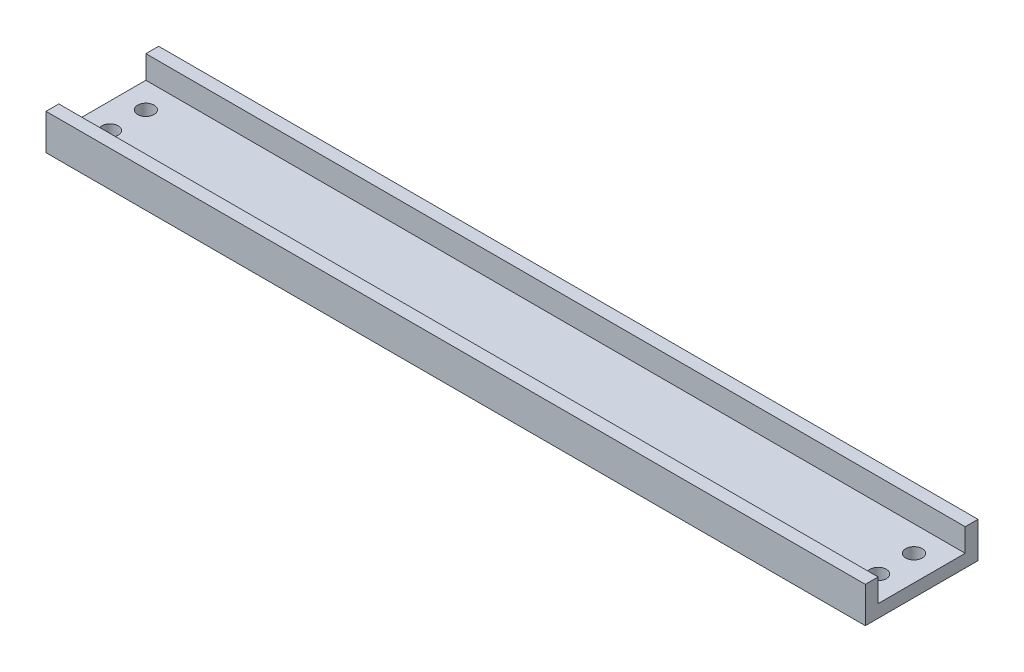
ISO-10303-21;
HEADER;
FILE_DESCRIPTION(('STEP AP214'),'2;1');
FILE_NAME('part.step','',(''),(''),'','','');
FILE_SCHEMA(('AUTOMOTIVE_DESIGN { 1 0 10303 214 1 1 1 1 }'));
ENDSEC;
DATA;
#1=APPLICATION_CONTEXT('core data for automotive mechanical design processes');
#2=APPLICATION_PROTOCOL_DEFINITION('international standard','automotive_design',2000,#1);
#3=PRODUCT_CONTEXT('',#1,'mechanical');
#4=PRODUCT('Part','Part','',(#3));
#5=PRODUCT_RELATED_PRODUCT_CATEGORY('part','',(#4));
#6=PRODUCT_DEFINITION_FORMATION('','',#4);
#7=PRODUCT_DEFINITION_CONTEXT('part definition',#1,'design');
#8=PRODUCT_DEFINITION('design','',#6,#7);
#9=PRODUCT_DEFINITION_SHAPE('','',#8);
#10=(LENGTH_UNIT() NAMED_UNIT(*) SI_UNIT(.MILLI.,.METRE.));
#11=(NAMED_UNIT(*) PLANE_ANGLE_UNIT() SI_UNIT($,.RADIAN.));
#12=(NAMED_UNIT(*) SI_UNIT($,.STERADIAN.) SOLID_ANGLE_UNIT());
#13=UNCERTAINTY_MEASURE_WITH_UNIT(LENGTH_MEASURE(1.E-05),#10,'distance_accuracy_value','');
#14=(GEOMETRIC_REPRESENTATION_CONTEXT(3) GLOBAL_UNCERTAINTY_ASSIGNED_CONTEXT((#13)) GLOBAL_UNIT_ASSIGNED_CONTEXT((#10,
#11,#12)) REPRESENTATION_CONTEXT('',''));
#15=CARTESIAN_POINT('',(0.,0.,0.));
#16=DIRECTION('',(0.,0.,1.));
#17=DIRECTION('',(1.,0.,0.));
#18=AXIS2_PLACEMENT_3D('',#15,#16,#17);
#19=CARTESIAN_POINT('',(0.,1.25,0.));
#20=DIRECTION('',(0.,1.,0.));
#21=DIRECTION('',(0.,0.,1.));
#22=AXIS2_PLACEMENT_3D('',#19,#20,#21);
#23=PLANE('',#22);
#24=CARTESIAN_POINT('',(-76.0810810810811,1.25,3.35585585585585));
#25=DIRECTION('',(0.,1.,0.));
#26=DIRECTION('',(0.,0.,-1.));
#27=AXIS2_PLACEMENT_3D('',#24,#25,#26);
#28=CIRCLE('',#27,1.60000000000001);
#29=CARTESIAN_POINT('',(-76.0810810810811,1.25,1.75585585585584));
#30=VERTEX_POINT('',#29);
#31=EDGE_CURVE('E333',#30,#30,#28,.T.);
#32=ORIENTED_EDGE('',*,*,#31,.F.);
#33=EDGE_LOOP('',(#32));
#34=FACE_BOUND('',#33,.T.);
#35=CARTESIAN_POINT('',(-76.0810810810811,1.25,10.3558558558558));
#36=DIRECTION('',(0.,1.,0.));
#37=DIRECTION('',(0.,0.,-1.));
#38=AXIS2_PLACEMENT_3D('',#35,#36,#37);
#39=CIRCLE('',#38,1.6);
#40=CARTESIAN_POINT('',(-76.0810810810811,1.25,8.75585585585585));
#41=VERTEX_POINT('',#40);
#42=EDGE_CURVE('E335',#41,#41,#39,.T.);
#43=ORIENTED_EDGE('',*,*,#42,.F.);
#44=EDGE_LOOP('',(#43));
#45=FACE_BOUND('',#44,.T.);
#46=CARTESIAN_POINT('',(73.9189189189189,1.25,10.3558558558558));
#47=DIRECTION('',(0.,1.,0.));
#48=DIRECTION('',(0.,0.,1.));
#49=AXIS2_PLACEMENT_3D('',#46,#47,#48);
#50=CIRCLE('',#49,1.6);
#51=CARTESIAN_POINT('',(73.9189189189189,1.25,11.9558558558559));
#52=VERTEX_POINT('',#51);
#53=EDGE_CURVE('E346',#52,#52,#50,.T.);
#54=ORIENTED_EDGE('',*,*,#53,.F.);
#55=EDGE_LOOP('',(#54));
#56=FACE_BOUND('',#55,.T.);
#57=CARTESIAN_POINT('',(73.9189189189189,1.25,3.35585585585585));
#58=DIRECTION('',(0.,1.,0.));
#59=DIRECTION('',(0.,0.,1.));
#60=AXIS2_PLACEMENT_3D('',#57,#58,#59);
#61=CIRCLE('',#60,1.60000000000001);
#62=CARTESIAN_POINT('',(73.9189189189189,1.25,4.95585585585585));
#63=VERTEX_POINT('',#62);
#64=EDGE_CURVE('E133',#63,#63,#61,.T.);
#65=ORIENTED_EDGE('',*,*,#64,.F.);
#66=EDGE_LOOP('',(#65));
#67=FACE_BOUND('',#66,.T.);
#68=DIRECTION('',(0.,0.,1.));
#69=VECTOR('',#68,1.);
#70=CARTESIAN_POINT('',(-81.0810810810811,1.25,-4.14414414414415));
#71=LINE('',#70,#69);
#72=CARTESIAN_POINT('',(-81.0810810810811,1.25,-1.64414414414415));
#73=VERTEX_POINT('',#72);
#74=CARTESIAN_POINT('',(-81.0810810810811,1.25,15.3558558558558));
#75=VERTEX_POINT('',#74);
#76=EDGE_CURVE('E161',#73,#75,#71,.T.);
#77=ORIENTED_EDGE('',*,*,#76,.T.);
#78=DIRECTION('',(-1.,0.,0.));
#79=VECTOR('',#78,1.);
#80=CARTESIAN_POINT('',(-81.0810810810811,1.25,15.3558558558558));
#81=LINE('',#80,#79);
#82=CARTESIAN_POINT('',(78.9189189189189,1.25,15.3558558558558));
#83=VERTEX_POINT('',#82);
#84=EDGE_CURVE('E128',#83,#75,#81,.T.);
#85=ORIENTED_EDGE('',*,*,#84,.F.);
#86=DIRECTION('',(0.,0.,-1.));
#87=VECTOR('',#86,1.);
#88=CARTESIAN_POINT('',(78.9189189189189,1.25,-4.14414414414415));
#89=LINE('',#88,#87);
#90=CARTESIAN_POINT('',(78.9189189189189,1.25,-1.64414414414415));
#91=VERTEX_POINT('',#90);
#92=EDGE_CURVE('E159',#83,#91,#89,.T.);
#93=ORIENTED_EDGE('',*,*,#92,.T.);
#94=DIRECTION('',(1.,0.,0.));
#95=VECTOR('',#94,1.);
#96=CARTESIAN_POINT('',(78.9189189189189,1.25,-1.64414414414415));
#97=LINE('',#96,#95);
#98=EDGE_CURVE('E60',#73,#91,#97,.T.);
#99=ORIENTED_EDGE('',*,*,#98,.F.);
#100=EDGE_LOOP('',(#77,#85,#93,#99));
#101=FACE_BOUND('',#100,.T.);
#102=ADVANCED_FACE('F37',(#34,#45,#56,#67,#101),#23,.T.);
#103=CARTESIAN_POINT('',(78.9189189189189,1.25,-4.14414414414415));
#104=DIRECTION('',(-1.,0.,0.));
#105=DIRECTION('',(0.,0.,1.));
#106=AXIS2_PLACEMENT_3D('',#103,#104,#105);
#107=PLANE('',#106);
#108=DIRECTION('',(0.,0.,-1.));
#109=VECTOR('',#108,1.);
#110=CARTESIAN_POINT('',(78.9189189189189,-1.25,-4.14414414414415));
#111=LINE('',#110,#109);
#112=CARTESIAN_POINT('',(78.9189189189189,-1.25,17.8558558558558));
#113=VERTEX_POINT('',#112);
#114=CARTESIAN_POINT('',(78.9189189189189,-1.25,-4.14414414414415));
#115=VERTEX_POINT('',#114);
#116=EDGE_CURVE('E158',#113,#115,#111,.T.);
#117=ORIENTED_EDGE('',*,*,#116,.T.);
#118=DIRECTION('',(0.,-1.,0.));
#119=VECTOR('',#118,1.);
#120=CARTESIAN_POINT('',(78.9189189189189,1.25,-4.14414414414415));
#121=LINE('',#120,#119);
#122=CARTESIAN_POINT('',(78.9189189189189,5.75,-4.14414414414415));
#123=VERTEX_POINT('',#122);
#124=EDGE_CURVE('E11',#123,#115,#121,.T.);
#125=ORIENTED_EDGE('',*,*,#124,.F.);
#126=DIRECTION('',(0.,0.,-1.));
#127=VECTOR('',#126,1.);
#128=CARTESIAN_POINT('',(78.9189189189189,5.75,-4.14414414414415));
#129=LINE('',#128,#127);
#130=CARTESIAN_POINT('',(78.9189189189189,5.75,-1.64414414414415));
#131=VERTEX_POINT('',#130);
#132=EDGE_CURVE('E141',#131,#123,#129,.T.);
#133=ORIENTED_EDGE('',*,*,#132,.F.);
#134=DIRECTION('',(0.,-1.,0.));
#135=VECTOR('',#134,1.);
#136=CARTESIAN_POINT('',(78.9189189189189,5.75,-1.64414414414415));
#137=LINE('',#136,#135);
#138=EDGE_CURVE('E151',#131,#91,#137,.T.);
#139=ORIENTED_EDGE('',*,*,#138,.T.);
#140=ORIENTED_EDGE('',*,*,#92,.F.);
#141=DIRECTION('',(0.,-1.,0.));
#142=VECTOR('',#141,1.);
#143=CARTESIAN_POINT('',(78.9189189189189,5.75,15.3558558558558));
#144=LINE('',#143,#142);
#145=CARTESIAN_POINT('',(78.9189189189189,5.75,15.3558558558558));
#146=VERTEX_POINT('',#145);
#147=EDGE_CURVE('E52',#146,#83,#144,.T.);
#148=ORIENTED_EDGE('',*,*,#147,.F.);
#149=DIRECTION('',(0.,0.,-1.));
#150=VECTOR('',#149,1.);
#151=CARTESIAN_POINT('',(78.9189189189189,5.75,17.8558558558558));
#152=LINE('',#151,#150);
#153=CARTESIAN_POINT('',(78.9189189189189,5.75,17.8558558558558));
#154=VERTEX_POINT('',#153);
#155=EDGE_CURVE('E123',#154,#146,#152,.T.);
#156=ORIENTED_EDGE('',*,*,#155,.F.);
#157=DIRECTION('',(0.,-1.,0.));
#158=VECTOR('',#157,1.);
#159=CARTESIAN_POINT('',(78.9189189189189,1.25,17.8558558558558));
#160=LINE('',#159,#158);
#161=EDGE_CURVE('E115',#154,#113,#160,.T.);
#162=ORIENTED_EDGE('',*,*,#161,.T.);
#163=EDGE_LOOP('',(#117,#125,#133,#139,#140,#148,#156,#162));
#164=FACE_BOUND('',#163,.T.);
#165=ADVANCED_FACE('F39',(#164),#107,.F.);
#166=CARTESIAN_POINT('',(-81.0810810810811,1.25,-4.14414414414415));
#167=DIRECTION('',(0.,0.,1.));
#168=DIRECTION('',(1.,0.,0.));
#169=AXIS2_PLACEMENT_3D('',#166,#167,#168);
#170=PLANE('',#169);
#171=DIRECTION('',(-1.,0.,0.));
#172=VECTOR('',#171,1.);
#173=CARTESIAN_POINT('',(-81.0810810810811,-1.25,-4.14414414414415));
#174=LINE('',#173,#172);
#175=CARTESIAN_POINT('',(-81.0810810810811,-1.25,-4.14414414414415));
#176=VERTEX_POINT('',#175);
#177=EDGE_CURVE('E166',#115,#176,#174,.T.);
#178=ORIENTED_EDGE('',*,*,#177,.T.);
#179=DIRECTION('',(0.,-1.,0.));
#180=VECTOR('',#179,1.);
#181=CARTESIAN_POINT('',(-81.0810810810811,1.25,-4.14414414414415));
#182=LINE('',#181,#180);
#183=CARTESIAN_POINT('',(-81.0810810810811,5.75,-4.14414414414415));
#184=VERTEX_POINT('',#183);
#185=EDGE_CURVE('E45',#184,#176,#182,.T.);
#186=ORIENTED_EDGE('',*,*,#185,.F.);
#187=DIRECTION('',(-1.,0.,0.));
#188=VECTOR('',#187,1.);
#189=CARTESIAN_POINT('',(78.9189189189189,5.75,-4.14414414414415));
#190=LINE('',#189,#188);
#191=EDGE_CURVE('E144',#123,#184,#190,.T.);
#192=ORIENTED_EDGE('',*,*,#191,.F.);
#193=ORIENTED_EDGE('',*,*,#124,.T.);
#194=EDGE_LOOP('',(#178,#186,#192,#193));
#195=FACE_BOUND('',#194,.T.);
#196=ADVANCED_FACE('F187',(#195),#170,.F.);
#197=CARTESIAN_POINT('',(-81.0810810810811,1.25,-4.14414414414415));
#198=DIRECTION('',(1.,0.,0.));
#199=DIRECTION('',(0.,0.,-1.));
#200=AXIS2_PLACEMENT_3D('',#197,#198,#199);
#201=PLANE('',#200);
#202=DIRECTION('',(0.,0.,1.));
#203=VECTOR('',#202,1.);
#204=CARTESIAN_POINT('',(-81.0810810810811,-1.25,-4.14414414414415));
#205=LINE('',#204,#203);
#206=CARTESIAN_POINT('',(-81.0810810810811,-1.25,17.8558558558558));
#207=VERTEX_POINT('',#206);
#208=EDGE_CURVE('E112',#176,#207,#205,.T.);
#209=ORIENTED_EDGE('',*,*,#208,.T.);
#210=DIRECTION('',(0.,-1.,0.));
#211=VECTOR('',#210,1.);
#212=CARTESIAN_POINT('',(-81.0810810810811,1.25,17.8558558558558));
#213=LINE('',#212,#211);
#214=CARTESIAN_POINT('',(-81.0810810810811,5.75,17.8558558558558));
#215=VERTEX_POINT('',#214);
#216=EDGE_CURVE('E104',#215,#207,#213,.T.);
#217=ORIENTED_EDGE('',*,*,#216,.F.);
#218=DIRECTION('',(0.,0.,1.));
#219=VECTOR('',#218,1.);
#220=CARTESIAN_POINT('',(-81.0810810810811,5.75,17.8558558558558));
#221=LINE('',#220,#219);
#222=CARTESIAN_POINT('',(-81.0810810810811,5.75,15.3558558558558));
#223=VERTEX_POINT('',#222);
#224=EDGE_CURVE('E109',#223,#215,#221,.T.);
#225=ORIENTED_EDGE('',*,*,#224,.F.);
#226=DIRECTION('',(0.,-1.,0.));
#227=VECTOR('',#226,1.);
#228=CARTESIAN_POINT('',(-81.0810810810811,5.75,15.3558558558558));
#229=LINE('',#228,#227);
#230=EDGE_CURVE('E137',#223,#75,#229,.T.);
#231=ORIENTED_EDGE('',*,*,#230,.T.);
#232=ORIENTED_EDGE('',*,*,#76,.F.);
#233=DIRECTION('',(0.,-1.,0.));
#234=VECTOR('',#233,1.);
#235=CARTESIAN_POINT('',(-81.0810810810811,5.75,-1.64414414414415));
#236=LINE('',#235,#234);
#237=CARTESIAN_POINT('',(-81.0810810810811,5.75,-1.64414414414415));
#238=VERTEX_POINT('',#237);
#239=EDGE_CURVE('E155',#238,#73,#236,.T.);
#240=ORIENTED_EDGE('',*,*,#239,.F.);
#241=DIRECTION('',(0.,0.,1.));
#242=VECTOR('',#241,1.);
#243=CARTESIAN_POINT('',(-81.0810810810811,5.75,-4.14414414414415));
#244=LINE('',#243,#242);
#245=EDGE_CURVE('E147',#184,#238,#244,.T.);
#246=ORIENTED_EDGE('',*,*,#245,.F.);
#247=ORIENTED_EDGE('',*,*,#185,.T.);
#248=EDGE_LOOP('',(#209,#217,#225,#231,#232,#240,#246,#247));
#249=FACE_BOUND('',#248,.T.);
#250=ADVANCED_FACE('F106',(#249),#201,.F.);
#251=CARTESIAN_POINT('',(-81.0810810810811,1.25,17.8558558558558));
#252=DIRECTION('',(0.,0.,-1.));
#253=DIRECTION('',(-1.,0.,0.));
#254=AXIS2_PLACEMENT_3D('',#251,#252,#253);
#255=PLANE('',#254);
#256=DIRECTION('',(1.,0.,0.));
#257=VECTOR('',#256,1.);
#258=CARTESIAN_POINT('',(-81.0810810810811,-1.25,17.8558558558558));
#259=LINE('',#258,#257);
#260=EDGE_CURVE('E162',#207,#113,#259,.T.);
#261=ORIENTED_EDGE('',*,*,#260,.T.);
#262=ORIENTED_EDGE('',*,*,#161,.F.);
#263=DIRECTION('',(1.,0.,0.));
#264=VECTOR('',#263,1.);
#265=CARTESIAN_POINT('',(-81.0810810810811,5.75,17.8558558558558));
#266=LINE('',#265,#264);
#267=EDGE_CURVE('E118',#215,#154,#266,.T.);
#268=ORIENTED_EDGE('',*,*,#267,.F.);
#269=ORIENTED_EDGE('',*,*,#216,.T.);
#270=EDGE_LOOP('',(#261,#262,#268,#269));
#271=FACE_BOUND('',#270,.T.);
#272=ADVANCED_FACE('F119',(#271),#255,.F.);
#273=CARTESIAN_POINT('',(0.,-1.25,0.));
#274=DIRECTION('',(0.,1.,0.));
#275=DIRECTION('',(0.,0.,1.));
#276=AXIS2_PLACEMENT_3D('',#273,#274,#275);
#277=PLANE('',#276);
#278=CARTESIAN_POINT('',(-76.0810810810811,-1.25,3.35585585585585));
#279=DIRECTION('',(0.,1.,0.));
#280=DIRECTION('',(0.,0.,-1.));
#281=AXIS2_PLACEMENT_3D('',#278,#279,#280);
#282=CIRCLE('',#281,1.60000000000001);
#283=CARTESIAN_POINT('',(-76.0810810810811,-1.25,1.75585585585584));
#284=VERTEX_POINT('',#283);
#285=EDGE_CURVE('E331',#284,#284,#282,.T.);
#286=ORIENTED_EDGE('',*,*,#285,.T.);
#287=EDGE_LOOP('',(#286));
#288=FACE_BOUND('',#287,.T.);
#289=CARTESIAN_POINT('',(-76.0810810810811,-1.25,10.3558558558558));
#290=DIRECTION('',(0.,1.,0.));
#291=DIRECTION('',(0.,0.,-1.));
#292=AXIS2_PLACEMENT_3D('',#289,#290,#291);
#293=CIRCLE('',#292,1.6);
#294=CARTESIAN_POINT('',(-76.0810810810811,-1.25,8.75585585585585));
#295=VERTEX_POINT('',#294);
#296=EDGE_CURVE('E351',#295,#295,#293,.T.);
#297=ORIENTED_EDGE('',*,*,#296,.T.);
#298=EDGE_LOOP('',(#297));
#299=FACE_BOUND('',#298,.T.);
#300=CARTESIAN_POINT('',(73.9189189189189,-1.25,10.3558558558558));
#301=DIRECTION('',(0.,1.,0.));
#302=DIRECTION('',(0.,0.,1.));
#303=AXIS2_PLACEMENT_3D('',#300,#301,#302);
#304=CIRCLE('',#303,1.6);
#305=CARTESIAN_POINT('',(73.9189189189189,-1.25,11.9558558558559));
#306=VERTEX_POINT('',#305);
#307=EDGE_CURVE('E342',#306,#306,#304,.T.);
#308=ORIENTED_EDGE('',*,*,#307,.T.);
#309=EDGE_LOOP('',(#308));
#310=FACE_BOUND('',#309,.T.);
#311=CARTESIAN_POINT('',(73.9189189189189,-1.25,3.35585585585585));
#312=DIRECTION('',(0.,1.,0.));
#313=DIRECTION('',(0.,0.,1.));
#314=AXIS2_PLACEMENT_3D('',#311,#312,#313);
#315=CIRCLE('',#314,1.60000000000001);
#316=CARTESIAN_POINT('',(73.9189189189189,-1.25,4.95585585585585));
#317=VERTEX_POINT('',#316);
#318=EDGE_CURVE('E130',#317,#317,#315,.T.);
#319=ORIENTED_EDGE('',*,*,#318,.T.);
#320=EDGE_LOOP('',(#319));
#321=FACE_BOUND('',#320,.T.);
#322=ORIENTED_EDGE('',*,*,#116,.F.);
#323=ORIENTED_EDGE('',*,*,#260,.F.);
#324=ORIENTED_EDGE('',*,*,#208,.F.);
#325=ORIENTED_EDGE('',*,*,#177,.F.);
#326=EDGE_LOOP('',(#322,#323,#324,#325));
#327=FACE_BOUND('',#326,.T.);
#328=ADVANCED_FACE('F176',(#288,#299,#310,#321,#327),#277,.F.);
#329=CARTESIAN_POINT('',(78.9189189189189,5.75,-1.64414414414415));
#330=DIRECTION('',(0.,0.,-1.));
#331=DIRECTION('',(-1.,0.,0.));
#332=AXIS2_PLACEMENT_3D('',#329,#330,#331);
#333=PLANE('',#332);
#334=ORIENTED_EDGE('',*,*,#98,.T.);
#335=ORIENTED_EDGE('',*,*,#138,.F.);
#336=DIRECTION('',(1.,0.,0.));
#337=VECTOR('',#336,1.);
#338=CARTESIAN_POINT('',(78.9189189189189,5.75,-1.64414414414415));
#339=LINE('',#338,#337);
#340=EDGE_CURVE('E149',#238,#131,#339,.T.);
#341=ORIENTED_EDGE('',*,*,#340,.F.);
#342=ORIENTED_EDGE('',*,*,#239,.T.);
#343=EDGE_LOOP('',(#334,#335,#341,#342));
#344=FACE_BOUND('',#343,.T.);
#345=ADVANCED_FACE('F182',(#344),#333,.F.);
#346=CARTESIAN_POINT('',(0.,5.75,0.));
#347=DIRECTION('',(0.,-1.,0.));
#348=DIRECTION('',(0.,0.,-1.));
#349=AXIS2_PLACEMENT_3D('',#346,#347,#348);
#350=PLANE('',#349);
#351=ORIENTED_EDGE('',*,*,#132,.T.);
#352=ORIENTED_EDGE('',*,*,#191,.T.);
#353=ORIENTED_EDGE('',*,*,#245,.T.);
#354=ORIENTED_EDGE('',*,*,#340,.T.);
#355=EDGE_LOOP('',(#351,#352,#353,#354));
#356=FACE_BOUND('',#355,.T.);
#357=ADVANCED_FACE('F186',(#356),#350,.F.);
#358=CARTESIAN_POINT('',(-81.0810810810811,5.75,15.3558558558558));
#359=DIRECTION('',(0.,0.,1.));
#360=DIRECTION('',(1.,0.,0.));
#361=AXIS2_PLACEMENT_3D('',#358,#359,#360);
#362=PLANE('',#361);
#363=ORIENTED_EDGE('',*,*,#84,.T.);
#364=ORIENTED_EDGE('',*,*,#230,.F.);
#365=DIRECTION('',(-1.,0.,0.));
#366=VECTOR('',#365,1.);
#367=CARTESIAN_POINT('',(-81.0810810810811,5.75,15.3558558558558));
#368=LINE('',#367,#366);
#369=EDGE_CURVE('E126',#146,#223,#368,.T.);
#370=ORIENTED_EDGE('',*,*,#369,.F.);
#371=ORIENTED_EDGE('',*,*,#147,.T.);
#372=EDGE_LOOP('',(#363,#364,#370,#371));
#373=FACE_BOUND('',#372,.T.);
#374=ADVANCED_FACE('F179',(#373),#362,.F.);
#375=CARTESIAN_POINT('',(0.,5.75,0.));
#376=DIRECTION('',(0.,-1.,0.));
#377=DIRECTION('',(0.,0.,-1.));
#378=AXIS2_PLACEMENT_3D('',#375,#376,#377);
#379=PLANE('',#378);
#380=ORIENTED_EDGE('',*,*,#224,.T.);
#381=ORIENTED_EDGE('',*,*,#267,.T.);
#382=ORIENTED_EDGE('',*,*,#155,.T.);
#383=ORIENTED_EDGE('',*,*,#369,.T.);
#384=EDGE_LOOP('',(#380,#381,#382,#383));
#385=FACE_BOUND('',#384,.T.);
#386=ADVANCED_FACE('F125',(#385),#379,.F.);
#387=CARTESIAN_POINT('',(73.9189189189189,-1.25,3.35585585585585));
#388=DIRECTION('',(0.,1.,0.));
#389=DIRECTION('',(0.,0.,1.));
#390=AXIS2_PLACEMENT_3D('',#387,#388,#389);
#391=CYLINDRICAL_SURFACE('',#390,1.60000000000001);
#392=ORIENTED_EDGE('',*,*,#318,.F.);
#393=EDGE_LOOP('',(#392));
#394=FACE_BOUND('',#393,.T.);
#395=ORIENTED_EDGE('',*,*,#64,.T.);
#396=EDGE_LOOP('',(#395));
#397=FACE_BOUND('',#396,.T.);
#398=ADVANCED_FACE('F239',(#394,#397),#391,.F.);
#399=CARTESIAN_POINT('',(73.9189189189189,-1.25,10.3558558558558));
#400=DIRECTION('',(0.,1.,0.));
#401=DIRECTION('',(0.,0.,1.));
#402=AXIS2_PLACEMENT_3D('',#399,#400,#401);
#403=CYLINDRICAL_SURFACE('',#402,1.6);
#404=ORIENTED_EDGE('',*,*,#307,.F.);
#405=EDGE_LOOP('',(#404));
#406=FACE_BOUND('',#405,.T.);
#407=ORIENTED_EDGE('',*,*,#53,.T.);
#408=EDGE_LOOP('',(#407));
#409=FACE_BOUND('',#408,.T.);
#410=ADVANCED_FACE('F245',(#406,#409),#403,.F.);
#411=CARTESIAN_POINT('',(-76.0810810810811,-1.25,10.3558558558558));
#412=DIRECTION('',(0.,1.,0.));
#413=DIRECTION('',(0.,0.,1.));
#414=AXIS2_PLACEMENT_3D('',#411,#412,#413);
#415=CYLINDRICAL_SURFACE('',#414,1.6);
#416=ORIENTED_EDGE('',*,*,#296,.F.);
#417=EDGE_LOOP('',(#416));
#418=FACE_BOUND('',#417,.T.);
#419=ORIENTED_EDGE('',*,*,#42,.T.);
#420=EDGE_LOOP('',(#419));
#421=FACE_BOUND('',#420,.T.);
#422=ADVANCED_FACE('F253',(#418,#421),#415,.F.);
#423=CARTESIAN_POINT('',(-76.0810810810811,-1.25,3.35585585585585));
#424=DIRECTION('',(0.,1.,0.));
#425=DIRECTION('',(0.,0.,1.));
#426=AXIS2_PLACEMENT_3D('',#423,#424,#425);
#427=CYLINDRICAL_SURFACE('',#426,1.60000000000001);
#428=ORIENTED_EDGE('',*,*,#285,.F.);
#429=EDGE_LOOP('',(#428));
#430=FACE_BOUND('',#429,.T.);
#431=ORIENTED_EDGE('',*,*,#31,.T.);
#432=EDGE_LOOP('',(#431));
#433=FACE_BOUND('',#432,.T.);
#434=ADVANCED_FACE('F261',(#430,#433),#427,.F.);
#435=CLOSED_SHELL('',(#102,#165,#196,#250,#272,#328,#345,#357,#374,#386,#398,#410,#422,#434));
#436=MANIFOLD_SOLID_BREP('B2',#435);
#437=ADVANCED_BREP_SHAPE_REPRESENTATION('',(#18,#436),#14);
#438=SHAPE_DEFINITION_REPRESENTATION(#9,#437);
ENDSEC;
END-ISO-10303-21;
